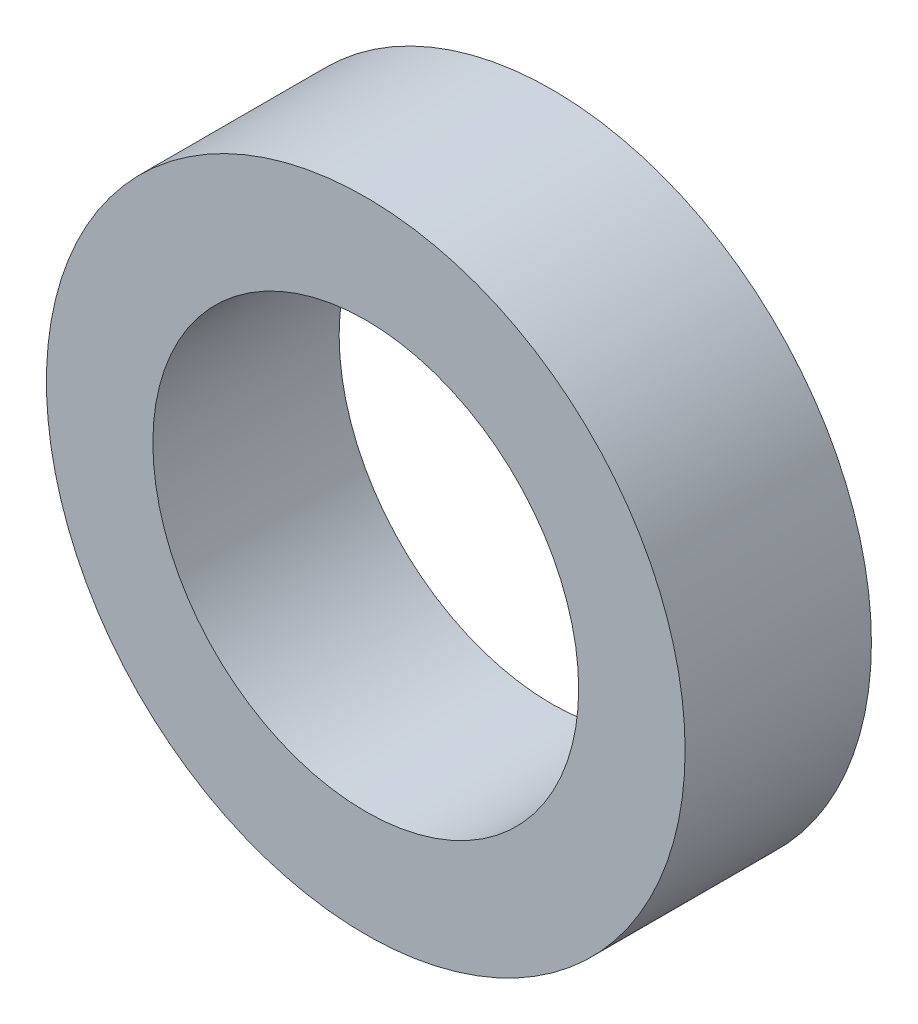
ISO-10303-21;
HEADER;
FILE_DESCRIPTION(('STEP AP214'),'2;1');
FILE_NAME('part.step','',(''),(''),'','','');
FILE_SCHEMA(('AUTOMOTIVE_DESIGN { 1 0 10303 214 1 1 1 1 }'));
ENDSEC;
DATA;
#1=APPLICATION_CONTEXT('core data for automotive mechanical design processes');
#2=APPLICATION_PROTOCOL_DEFINITION('international standard','automotive_design',2000,#1);
#3=PRODUCT_CONTEXT('',#1,'mechanical');
#4=PRODUCT('Part','Part','',(#3));
#5=PRODUCT_RELATED_PRODUCT_CATEGORY('part','',(#4));
#6=PRODUCT_DEFINITION_FORMATION('','',#4);
#7=PRODUCT_DEFINITION_CONTEXT('part definition',#1,'design');
#8=PRODUCT_DEFINITION('design','',#6,#7);
#9=PRODUCT_DEFINITION_SHAPE('','',#8);
#10=(LENGTH_UNIT() NAMED_UNIT(*) SI_UNIT(.MILLI.,.METRE.));
#11=(NAMED_UNIT(*) PLANE_ANGLE_UNIT() SI_UNIT($,.RADIAN.));
#12=(NAMED_UNIT(*) SI_UNIT($,.STERADIAN.) SOLID_ANGLE_UNIT());
#13=UNCERTAINTY_MEASURE_WITH_UNIT(LENGTH_MEASURE(1.E-05),#10,'distance_accuracy_value','');
#14=(GEOMETRIC_REPRESENTATION_CONTEXT(3) GLOBAL_UNCERTAINTY_ASSIGNED_CONTEXT((#13)) GLOBAL_UNIT_ASSIGNED_CONTEXT((#10,
#11,#12)) REPRESENTATION_CONTEXT('',''));
#15=CARTESIAN_POINT('',(0.,0.,0.));
#16=DIRECTION('',(0.,0.,1.));
#17=DIRECTION('',(1.,0.,0.));
#18=AXIS2_PLACEMENT_3D('',#15,#16,#17);
#19=CARTESIAN_POINT('',(0.,0.,3.5));
#20=DIRECTION('',(0.,0.,1.));
#21=DIRECTION('',(1.,0.,0.));
#22=AXIS2_PLACEMENT_3D('',#19,#20,#21);
#23=PLANE('',#22);
#24=CARTESIAN_POINT('',(0.,0.,3.5));
#25=DIRECTION('',(0.,0.,1.));
#26=DIRECTION('',(1.,0.,0.));
#27=AXIS2_PLACEMENT_3D('',#24,#25,#26);
#28=CIRCLE('',#27,6.);
#29=CARTESIAN_POINT('',(6.,0.,3.5));
#30=VERTEX_POINT('',#29);
#31=EDGE_CURVE('E10',#30,#30,#28,.T.);
#32=ORIENTED_EDGE('',*,*,#31,.T.);
#33=EDGE_LOOP('',(#32));
#34=FACE_BOUND('',#33,.T.);
#35=CARTESIAN_POINT('',(0.,0.,3.5));
#36=DIRECTION('',(0.,0.,1.));
#37=DIRECTION('',(1.,0.,0.));
#38=AXIS2_PLACEMENT_3D('',#35,#36,#37);
#39=CIRCLE('',#38,4.);
#40=CARTESIAN_POINT('',(4.,0.,3.5));
#41=VERTEX_POINT('',#40);
#42=EDGE_CURVE('E41',#41,#41,#39,.T.);
#43=ORIENTED_EDGE('',*,*,#42,.F.);
#44=EDGE_LOOP('',(#43));
#45=FACE_BOUND('',#44,.T.);
#46=ADVANCED_FACE('F30',(#34,#45),#23,.T.);
#47=CARTESIAN_POINT('',(0.,0.,0.));
#48=DIRECTION('',(0.,0.,1.));
#49=DIRECTION('',(1.,0.,0.));
#50=AXIS2_PLACEMENT_3D('',#47,#48,#49);
#51=PLANE('',#50);
#52=CARTESIAN_POINT('',(0.,0.,0.));
#53=DIRECTION('',(0.,0.,1.));
#54=DIRECTION('',(1.,0.,0.));
#55=AXIS2_PLACEMENT_3D('',#52,#53,#54);
#56=CIRCLE('',#55,6.);
#57=CARTESIAN_POINT('',(6.,0.,0.));
#58=VERTEX_POINT('',#57);
#59=EDGE_CURVE('E34',#58,#58,#56,.T.);
#60=ORIENTED_EDGE('',*,*,#59,.F.);
#61=EDGE_LOOP('',(#60));
#62=FACE_BOUND('',#61,.T.);
#63=CARTESIAN_POINT('',(0.,0.,0.));
#64=DIRECTION('',(0.,0.,1.));
#65=DIRECTION('',(1.,0.,0.));
#66=AXIS2_PLACEMENT_3D('',#63,#64,#65);
#67=CIRCLE('',#66,4.);
#68=CARTESIAN_POINT('',(4.,0.,0.));
#69=VERTEX_POINT('',#68);
#70=EDGE_CURVE('E43',#69,#69,#67,.T.);
#71=ORIENTED_EDGE('',*,*,#70,.T.);
#72=EDGE_LOOP('',(#71));
#73=FACE_BOUND('',#72,.T.);
#74=ADVANCED_FACE('F53',(#62,#73),#51,.F.);
#75=CARTESIAN_POINT('',(0.,0.,3.5));
#76=DIRECTION('',(0.,0.,-1.));
#77=DIRECTION('',(-1.,0.,0.));
#78=AXIS2_PLACEMENT_3D('',#75,#76,#77);
#79=CYLINDRICAL_SURFACE('',#78,6.);
#80=ORIENTED_EDGE('',*,*,#31,.F.);
#81=EDGE_LOOP('',(#80));
#82=FACE_BOUND('',#81,.T.);
#83=ORIENTED_EDGE('',*,*,#59,.T.);
#84=EDGE_LOOP('',(#83));
#85=FACE_BOUND('',#84,.T.);
#86=ADVANCED_FACE('F32',(#82,#85),#79,.T.);
#87=CARTESIAN_POINT('',(0.,0.,3.5));
#88=DIRECTION('',(0.,0.,-1.));
#89=DIRECTION('',(-1.,0.,0.));
#90=AXIS2_PLACEMENT_3D('',#87,#88,#89);
#91=CYLINDRICAL_SURFACE('',#90,4.);
#92=ORIENTED_EDGE('',*,*,#42,.T.);
#93=EDGE_LOOP('',(#92));
#94=FACE_BOUND('',#93,.T.);
#95=ORIENTED_EDGE('',*,*,#70,.F.);
#96=EDGE_LOOP('',(#95));
#97=FACE_BOUND('',#96,.T.);
#98=ADVANCED_FACE('F49',(#94,#97),#91,.F.);
#99=CLOSED_SHELL('',(#46,#74,#86,#98));
#100=MANIFOLD_SOLID_BREP('B2',#99);
#101=ADVANCED_BREP_SHAPE_REPRESENTATION('',(#18,#100),#14);
#102=SHAPE_DEFINITION_REPRESENTATION(#9,#101);
ENDSEC;
END-ISO-10303-21;
